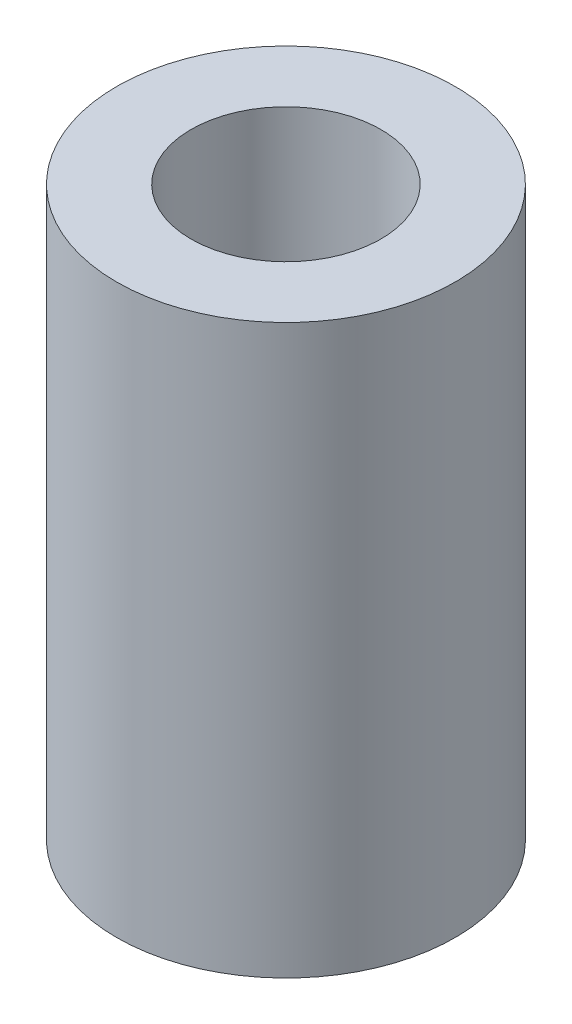
ISO-10303-21;
HEADER;
FILE_DESCRIPTION(('STEP AP214'),'2;1');
FILE_NAME('part.step','',(''),(''),'','','');
FILE_SCHEMA(('AUTOMOTIVE_DESIGN { 1 0 10303 214 1 1 1 1 }'));
ENDSEC;
DATA;
#1=APPLICATION_CONTEXT('core data for automotive mechanical design processes');
#2=APPLICATION_PROTOCOL_DEFINITION('international standard','automotive_design',2000,#1);
#3=PRODUCT_CONTEXT('',#1,'mechanical');
#4=PRODUCT('Part','Part','',(#3));
#5=PRODUCT_RELATED_PRODUCT_CATEGORY('part','',(#4));
#6=PRODUCT_DEFINITION_FORMATION('','',#4);
#7=PRODUCT_DEFINITION_CONTEXT('part definition',#1,'design');
#8=PRODUCT_DEFINITION('design','',#6,#7);
#9=PRODUCT_DEFINITION_SHAPE('','',#8);
#10=(LENGTH_UNIT() NAMED_UNIT(*) SI_UNIT(.MILLI.,.METRE.));
#11=(NAMED_UNIT(*) PLANE_ANGLE_UNIT() SI_UNIT($,.RADIAN.));
#12=(NAMED_UNIT(*) SI_UNIT($,.STERADIAN.) SOLID_ANGLE_UNIT());
#13=UNCERTAINTY_MEASURE_WITH_UNIT(LENGTH_MEASURE(1.E-05),#10,'distance_accuracy_value','');
#14=(GEOMETRIC_REPRESENTATION_CONTEXT(3) GLOBAL_UNCERTAINTY_ASSIGNED_CONTEXT((#13)) GLOBAL_UNIT_ASSIGNED_CONTEXT((#10,
#11,#12)) REPRESENTATION_CONTEXT('',''));
#15=CARTESIAN_POINT('',(0.,0.,0.));
#16=DIRECTION('',(0.,0.,1.));
#17=DIRECTION('',(1.,0.,0.));
#18=AXIS2_PLACEMENT_3D('',#15,#16,#17);
#19=CARTESIAN_POINT('',(0.,25.1447715660304,0.));
#20=DIRECTION('',(0.,-1.,0.));
#21=DIRECTION('',(0.,0.,-1.));
#22=AXIS2_PLACEMENT_3D('',#19,#20,#21);
#23=CYLINDRICAL_SURFACE('',#22,7.5);
#24=CARTESIAN_POINT('',(0.,25.1447715660304,0.));
#25=DIRECTION('',(0.,1.,0.));
#26=DIRECTION('',(0.,0.,1.));
#27=AXIS2_PLACEMENT_3D('',#24,#25,#26);
#28=CIRCLE('',#27,7.5);
#29=CARTESIAN_POINT('',(0.,25.1447715660304,7.5));
#30=VERTEX_POINT('',#29);
#31=EDGE_CURVE('E10',#30,#30,#28,.T.);
#32=ORIENTED_EDGE('',*,*,#31,.F.);
#33=EDGE_LOOP('',(#32));
#34=FACE_BOUND('',#33,.T.);
#35=CARTESIAN_POINT('',(0.,0.,0.));
#36=DIRECTION('',(0.,1.,0.));
#37=DIRECTION('',(0.,0.,1.));
#38=AXIS2_PLACEMENT_3D('',#35,#36,#37);
#39=CIRCLE('',#38,7.5);
#40=CARTESIAN_POINT('',(0.,0.,7.5));
#41=VERTEX_POINT('',#40);
#42=EDGE_CURVE('E37',#41,#41,#39,.T.);
#43=ORIENTED_EDGE('',*,*,#42,.T.);
#44=EDGE_LOOP('',(#43));
#45=FACE_BOUND('',#44,.T.);
#46=ADVANCED_FACE('F40',(#34,#45),#23,.T.);
#47=CARTESIAN_POINT('',(0.,25.1447715660304,0.));
#48=DIRECTION('',(0.,1.,0.));
#49=DIRECTION('',(0.,0.,1.));
#50=AXIS2_PLACEMENT_3D('',#47,#48,#49);
#51=PLANE('',#50);
#52=CARTESIAN_POINT('',(0.,25.1447715660304,0.));
#53=DIRECTION('',(0.,1.,0.));
#54=DIRECTION('',(0.,0.,1.));
#55=AXIS2_PLACEMENT_3D('',#52,#53,#54);
#56=CIRCLE('',#55,4.20520220491429);
#57=CARTESIAN_POINT('',(0.,25.1447715660304,4.20520220491429));
#58=VERTEX_POINT('',#57);
#59=EDGE_CURVE('E50',#58,#58,#56,.T.);
#60=ORIENTED_EDGE('',*,*,#59,.F.);
#61=EDGE_LOOP('',(#60));
#62=FACE_BOUND('',#61,.T.);
#63=ORIENTED_EDGE('',*,*,#31,.T.);
#64=EDGE_LOOP('',(#63));
#65=FACE_BOUND('',#64,.T.);
#66=ADVANCED_FACE('F59',(#62,#65),#51,.T.);
#67=CARTESIAN_POINT('',(0.,0.,0.));
#68=DIRECTION('',(0.,1.,0.));
#69=DIRECTION('',(0.,0.,1.));
#70=AXIS2_PLACEMENT_3D('',#67,#68,#69);
#71=PLANE('',#70);
#72=CARTESIAN_POINT('',(0.,0.,0.));
#73=DIRECTION('',(0.,1.,0.));
#74=DIRECTION('',(0.,0.,1.));
#75=AXIS2_PLACEMENT_3D('',#72,#73,#74);
#76=CIRCLE('',#75,4.20520220491429);
#77=CARTESIAN_POINT('',(0.,0.,4.20520220491429));
#78=VERTEX_POINT('',#77);
#79=EDGE_CURVE('E47',#78,#78,#76,.T.);
#80=ORIENTED_EDGE('',*,*,#79,.T.);
#81=EDGE_LOOP('',(#80));
#82=FACE_BOUND('',#81,.T.);
#83=ORIENTED_EDGE('',*,*,#42,.F.);
#84=EDGE_LOOP('',(#83));
#85=FACE_BOUND('',#84,.T.);
#86=ADVANCED_FACE('F58',(#82,#85),#71,.F.);
#87=CARTESIAN_POINT('',(0.,25.1447715660304,0.));
#88=DIRECTION('',(0.,-1.,0.));
#89=DIRECTION('',(0.,0.,-1.));
#90=AXIS2_PLACEMENT_3D('',#87,#88,#89);
#91=CYLINDRICAL_SURFACE('',#90,4.20520220491429);
#92=ORIENTED_EDGE('',*,*,#59,.T.);
#93=EDGE_LOOP('',(#92));
#94=FACE_BOUND('',#93,.T.);
#95=ORIENTED_EDGE('',*,*,#79,.F.);
#96=EDGE_LOOP('',(#95));
#97=FACE_BOUND('',#96,.T.);
#98=ADVANCED_FACE('F54',(#94,#97),#91,.F.);
#99=CLOSED_SHELL('',(#46,#66,#86,#98));
#100=MANIFOLD_SOLID_BREP('B2',#99);
#101=ADVANCED_BREP_SHAPE_REPRESENTATION('',(#18,#100),#14);
#102=SHAPE_DEFINITION_REPRESENTATION(#9,#101);
ENDSEC;
END-ISO-10303-21;
